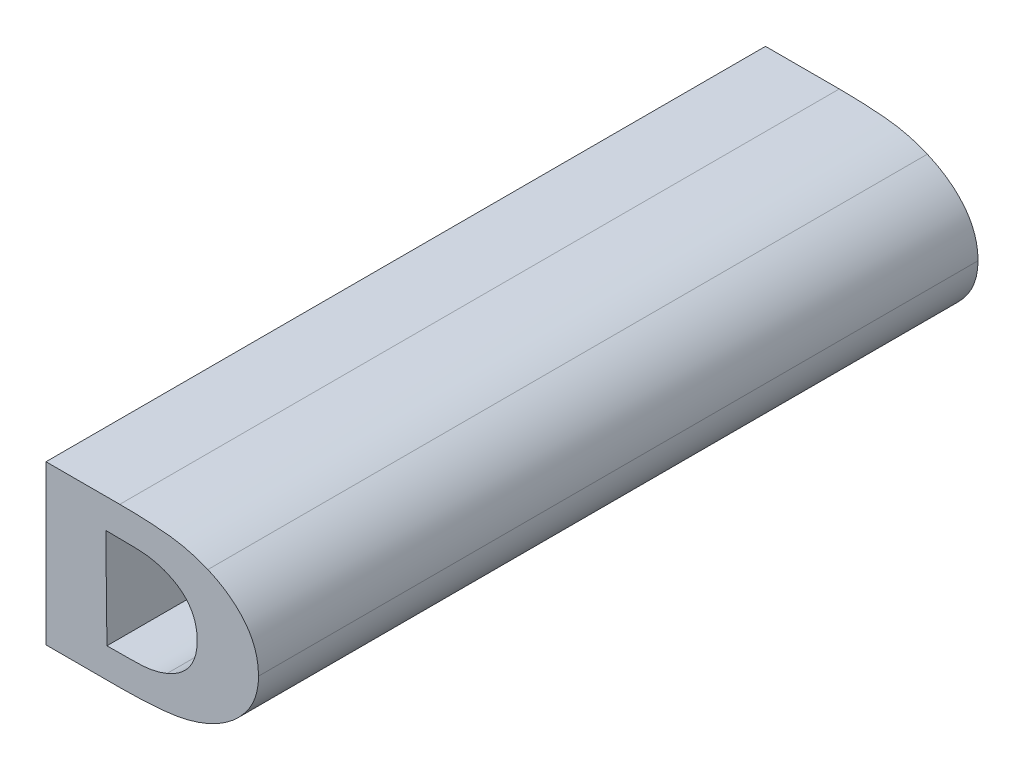
ISO-10303-21;
HEADER;
FILE_DESCRIPTION(('STEP AP214'),'2;1');
FILE_NAME('part.step','',(''),(''),'','','');
FILE_SCHEMA(('AUTOMOTIVE_DESIGN { 1 0 10303 214 1 1 1 1 }'));
ENDSEC;
DATA;
#1=APPLICATION_CONTEXT('core data for automotive mechanical design processes');
#2=APPLICATION_PROTOCOL_DEFINITION('international standard','automotive_design',2000,#1);
#3=PRODUCT_CONTEXT('',#1,'mechanical');
#4=PRODUCT('Part','Part','',(#3));
#5=PRODUCT_RELATED_PRODUCT_CATEGORY('part','',(#4));
#6=PRODUCT_DEFINITION_FORMATION('','',#4);
#7=PRODUCT_DEFINITION_CONTEXT('part definition',#1,'design');
#8=PRODUCT_DEFINITION('design','',#6,#7);
#9=PRODUCT_DEFINITION_SHAPE('','',#8);
#10=(LENGTH_UNIT() NAMED_UNIT(*) SI_UNIT(.MILLI.,.METRE.));
#11=(NAMED_UNIT(*) PLANE_ANGLE_UNIT() SI_UNIT($,.RADIAN.));
#12=(NAMED_UNIT(*) SI_UNIT($,.STERADIAN.) SOLID_ANGLE_UNIT());
#13=UNCERTAINTY_MEASURE_WITH_UNIT(LENGTH_MEASURE(1.E-05),#10,'distance_accuracy_value','');
#14=(GEOMETRIC_REPRESENTATION_CONTEXT(3) GLOBAL_UNCERTAINTY_ASSIGNED_CONTEXT((#13)) GLOBAL_UNIT_ASSIGNED_CONTEXT((#10,
#11,#12)) REPRESENTATION_CONTEXT('',''));
#15=CARTESIAN_POINT('',(0.,0.,0.));
#16=DIRECTION('',(0.,0.,1.));
#17=DIRECTION('',(1.,0.,0.));
#18=AXIS2_PLACEMENT_3D('',#15,#16,#17);
#19=CARTESIAN_POINT('',(-1.2249384485095,-0.398085013600293,0.));
#20=CARTESIAN_POINT('',(-1.2249384485095,-0.398085013600293,0.1));
#21=CARTESIAN_POINT('',(-1.2228835457298,-0.397227315048791,0.));
#22=CARTESIAN_POINT('',(-1.2228835457298,-0.397227315048791,0.1));
#23=CARTESIAN_POINT('',(-1.2207571680709,-0.394207501398713,0.));
#24=CARTESIAN_POINT('',(-1.2207571680709,-0.394207501398713,0.1));
#25=CARTESIAN_POINT('',(-1.2207571680709,-0.392027517580314,0.));
#26=CARTESIAN_POINT('',(-1.2207571680709,-0.392027517580314,0.1));
#27=B_SPLINE_SURFACE_WITH_KNOTS('',2,1,((#19,#20),(#21,#22),(#23,#24),(#25,#26)),.UNSPECIFIED.,
.F.,.F.,.F.,(3,1,3),(2,2),(0.,1.,2.),(0.,0.01),.UNSPECIFIED.);
#28=CARTESIAN_POINT('',(-1.2249384485095,-0.398085013600293,0.));
#29=CARTESIAN_POINT('',(-1.2228835457298,-0.397227315048791,0.));
#30=CARTESIAN_POINT('',(-1.2207571680709,-0.394207501398713,0.));
#31=CARTESIAN_POINT('',(-1.2207571680709,-0.392027517580314,0.));
#32=B_SPLINE_CURVE_WITH_KNOTS('',2,(#28,#29,#30,#31),.UNSPECIFIED.,.F.,.F.,(3,1,3),(0.,1.,2.),.UNSPECIFIED.);
#33=CARTESIAN_POINT('',(-1.2249384485095,-0.398085013600293,0.));
#34=VERTEX_POINT('',#33);
#35=CARTESIAN_POINT('',(-1.2207571680709,-0.392027517580314,0.));
#36=VERTEX_POINT('',#35);
#37=EDGE_CURVE('E11',#34,#36,#32,.T.);
#38=DIRECTION('',(0.,0.,1.));
#39=VECTOR('',#38,1.);
#40=CARTESIAN_POINT('',(-1.2249384485095,-0.398085013600293,0.));
#41=LINE('',#40,#39);
#42=CARTESIAN_POINT('',(-1.2249384485095,-0.398085013600293,0.1));
#43=VERTEX_POINT('',#42);
#44=EDGE_CURVE('E28',#34,#43,#41,.T.);
#45=CARTESIAN_POINT('',(-1.2207571680709,-0.392027517580314,0.1));
#46=CARTESIAN_POINT('',(-1.2207571680709,-0.394207501398713,0.1));
#47=CARTESIAN_POINT('',(-1.2228835457298,-0.397227315048791,0.1));
#48=CARTESIAN_POINT('',(-1.2249384485095,-0.398085013600293,0.1));
#49=B_SPLINE_CURVE_WITH_KNOTS('',2,(#45,#46,#47,#48),.UNSPECIFIED.,.F.,.F.,(3,1,3),(-2.,-1.,0.),.UNSPECIFIED.);
#50=CARTESIAN_POINT('',(-1.2207571680709,-0.392027517580314,0.1));
#51=VERTEX_POINT('',#50);
#52=EDGE_CURVE('E329',#51,#43,#49,.T.);
#53=DIRECTION('',(0.,0.,1.));
#54=VECTOR('',#53,1.);
#55=CARTESIAN_POINT('',(-1.2207571680709,-0.392027517580314,0.));
#56=LINE('',#55,#54);
#57=EDGE_CURVE('E41',#36,#51,#56,.T.);
#58=ORIENTED_EDGE('',*,*,#37,.F.);
#59=ORIENTED_EDGE('',*,*,#44,.T.);
#60=ORIENTED_EDGE('',*,*,#52,.F.);
#61=ORIENTED_EDGE('',*,*,#57,.F.);
#62=EDGE_LOOP('',(#58,#59,#60,#61));
#63=FACE_BOUND('',#62,.T.);
#64=ADVANCED_FACE('F17',(#63),#27,.F.);
#65=CARTESIAN_POINT('',(-1.2333010093866,-0.398942712151794,0.));
#66=CARTESIAN_POINT('',(-1.2333010093866,-0.398942712151794,0.1));
#67=CARTESIAN_POINT('',(-1.2305134890942,-0.398942712151794,0.));
#68=CARTESIAN_POINT('',(-1.2305134890942,-0.398942712151794,0.1));
#69=CARTESIAN_POINT('',(-1.2266717143323,-0.398817631113033,0.));
#70=CARTESIAN_POINT('',(-1.2266717143323,-0.398817631113033,0.1));
#71=CARTESIAN_POINT('',(-1.2249384485095,-0.398085013600293,0.));
#72=CARTESIAN_POINT('',(-1.2249384485095,-0.398085013600293,0.1));
#73=B_SPLINE_SURFACE_WITH_KNOTS('',2,1,((#65,#66),(#67,#68),(#69,#70),(#71,#72)),.UNSPECIFIED.,
.F.,.F.,.F.,(3,1,3),(2,2),(0.,1.,2.),(0.,0.01),.UNSPECIFIED.);
#74=CARTESIAN_POINT('',(-1.2333010093866,-0.398942712151794,0.));
#75=CARTESIAN_POINT('',(-1.2305134890942,-0.398942712151794,0.));
#76=CARTESIAN_POINT('',(-1.2266717143323,-0.398817631113033,0.));
#77=CARTESIAN_POINT('',(-1.2249384485095,-0.398085013600293,0.));
#78=B_SPLINE_CURVE_WITH_KNOTS('',2,(#74,#75,#76,#77),.UNSPECIFIED.,.F.,.F.,(3,1,3),(0.,1.,2.),.UNSPECIFIED.);
#79=CARTESIAN_POINT('',(-1.2333010093866,-0.398942712151794,0.));
#80=VERTEX_POINT('',#79);
#81=EDGE_CURVE('E322',#80,#34,#78,.T.);
#82=CARTESIAN_POINT('',(-1.2333010093866,-0.398942712151794,0.));
#83=CARTESIAN_POINT('',(-1.2333010093866,-0.398942712151794,0.00416666666666667));
#84=CARTESIAN_POINT('',(-1.2333010093866,-0.398942712151794,0.00833333333333334));
#85=CARTESIAN_POINT('',(-1.2333010093866,-0.398942712151794,0.0166666666666667));
#86=CARTESIAN_POINT('',(-1.2333010093866,-0.398942712151794,0.0208333333333333));
#87=CARTESIAN_POINT('',(-1.2333010093866,-0.398942712151794,0.0291666666666667));
#88=CARTESIAN_POINT('',(-1.2333010093866,-0.398942712151794,0.0333333333333333));
#89=CARTESIAN_POINT('',(-1.2333010093866,-0.398942712151794,0.0416666666666667));
#90=CARTESIAN_POINT('',(-1.2333010093866,-0.398942712151794,0.0458333333333333));
#91=CARTESIAN_POINT('',(-1.2333010093866,-0.398942712151794,0.0541666666666667));
#92=CARTESIAN_POINT('',(-1.2333010093866,-0.398942712151794,0.0583333333333333));
#93=CARTESIAN_POINT('',(-1.2333010093866,-0.398942712151794,0.0666666666666667));
#94=CARTESIAN_POINT('',(-1.2333010093866,-0.398942712151794,0.0708333333333333));
#95=CARTESIAN_POINT('',(-1.2333010093866,-0.398942712151794,0.0791666666666667));
#96=CARTESIAN_POINT('',(-1.2333010093866,-0.398942712151794,0.0833333333333333));
#97=CARTESIAN_POINT('',(-1.2333010093866,-0.398942712151794,0.0916666666666667));
#98=CARTESIAN_POINT('',(-1.2333010093866,-0.398942712151794,0.0958333333333333));
#99=CARTESIAN_POINT('',(-1.2333010093866,-0.398942712151794,0.1));
#100=B_SPLINE_CURVE_WITH_KNOTS('',3,(#82,#83,#84,#85,#86,#87,#88,#89,#90,#91,#92,#93,#94,#95,
#96,#97,#98,#99),.UNSPECIFIED.,.F.,.F.,(4,2,2,2,2,2,2,2,4),(0.,0.0125,0.025,0.0375,0.05,0.0625,
0.075,0.0875,0.1),.UNSPECIFIED.);
#101=CARTESIAN_POINT('',(-1.2333010093866,-0.398942712151794,0.1));
#102=VERTEX_POINT('',#101);
#103=EDGE_CURVE('E277',#80,#102,#100,.T.);
#104=CARTESIAN_POINT('',(-1.2249384485095,-0.398085013600293,0.1));
#105=CARTESIAN_POINT('',(-1.2266717143323,-0.398817631113033,0.1));
#106=CARTESIAN_POINT('',(-1.2305134890942,-0.398942712151794,0.1));
#107=CARTESIAN_POINT('',(-1.2333010093866,-0.398942712151794,0.1));
#108=B_SPLINE_CURVE_WITH_KNOTS('',2,(#104,#105,#106,#107),.UNSPECIFIED.,.F.,.F.,(3,1,3),(-2.,
-1.,0.),.UNSPECIFIED.);
#109=EDGE_CURVE('E268',#43,#102,#108,.T.);
#110=ORIENTED_EDGE('',*,*,#81,.F.);
#111=ORIENTED_EDGE('',*,*,#103,.T.);
#112=ORIENTED_EDGE('',*,*,#109,.F.);
#113=ORIENTED_EDGE('',*,*,#44,.F.);
#114=EDGE_LOOP('',(#110,#111,#112,#113));
#115=FACE_BOUND('',#114,.T.);
#116=ADVANCED_FACE('F293',(#115),#73,.F.);
#117=CARTESIAN_POINT('',(-1.233461827865,-0.385130191728657,0.));
#118=DIRECTION('',(-1.,0.,0.));
#119=DIRECTION('',(0.,-1.,0.));
#120=AXIS2_PLACEMENT_3D('',#117,#118,#119);
#121=PLANE('',#120);
#122=DIRECTION('',(0.,-1.,0.));
#123=VECTOR('',#122,1.);
#124=CARTESIAN_POINT('',(-1.233461827865,-0.38858289968363,0.));
#125=LINE('',#124,#123);
#126=CARTESIAN_POINT('',(-1.233461827865,-0.385130191728657,0.));
#127=VERTEX_POINT('',#126);
#128=EDGE_CURVE('E263',#127,#80,#125,.T.);
#129=ORIENTED_EDGE('',*,*,#128,.F.);
#130=DIRECTION('',(0.,0.,1.));
#131=VECTOR('',#130,1.);
#132=CARTESIAN_POINT('',(-1.233461827865,-0.385130191728657,0.));
#133=LINE('',#132,#131);
#134=CARTESIAN_POINT('',(-1.233461827865,-0.385130191728657,0.1));
#135=VERTEX_POINT('',#134);
#136=EDGE_CURVE('E259',#127,#135,#133,.T.);
#137=ORIENTED_EDGE('',*,*,#136,.T.);
#138=DIRECTION('',(0.,1.,0.));
#139=VECTOR('',#138,1.);
#140=CARTESIAN_POINT('',(-1.233461827865,-0.38858289968363,0.1));
#141=LINE('',#140,#139);
#142=EDGE_CURVE('E254',#102,#135,#141,.T.);
#143=ORIENTED_EDGE('',*,*,#142,.F.);
#144=ORIENTED_EDGE('',*,*,#103,.F.);
#145=EDGE_LOOP('',(#129,#137,#143,#144));
#146=FACE_BOUND('',#145,.T.);
#147=ADVANCED_FACE('F283',(#146),#121,.F.);
#148=CARTESIAN_POINT('',(-1.2253315603456,-0.385862809241398,0.));
#149=CARTESIAN_POINT('',(-1.2253315603456,-0.385862809241398,0.1));
#150=CARTESIAN_POINT('',(-1.2270290887288,-0.385255272767417,0.));
#151=CARTESIAN_POINT('',(-1.2270290887288,-0.385255272767417,0.1));
#152=CARTESIAN_POINT('',(-1.2307279137321,-0.385130191728657,0.));
#153=CARTESIAN_POINT('',(-1.2307279137321,-0.385130191728657,0.1));
#154=CARTESIAN_POINT('',(-1.2333010093866,-0.385130191728657,0.));
#155=CARTESIAN_POINT('',(-1.2333010093866,-0.385130191728657,0.1));
#156=B_SPLINE_SURFACE_WITH_KNOTS('',2,1,((#148,#149),(#150,#151),(#152,#153),(#154,#155)),
.UNSPECIFIED.,.F.,.F.,.F.,(3,1,3),(2,2),(0.,1.,2.),(0.,0.01),.UNSPECIFIED.);
#157=CARTESIAN_POINT('',(-1.2253315603456,-0.385862809241398,0.));
#158=CARTESIAN_POINT('',(-1.2270290887288,-0.385255272767417,0.));
#159=CARTESIAN_POINT('',(-1.2307279137321,-0.385130191728657,0.));
#160=CARTESIAN_POINT('',(-1.2333010093866,-0.385130191728657,0.));
#161=B_SPLINE_CURVE_WITH_KNOTS('',2,(#157,#158,#159,#160),.UNSPECIFIED.,.F.,.F.,(3,1,3),(0.,1.,
2.),.UNSPECIFIED.);
#162=CARTESIAN_POINT('',(-1.2253315603456,-0.385862809241398,0.));
#163=VERTEX_POINT('',#162);
#164=EDGE_CURVE('E244',#163,#127,#161,.T.);
#165=DIRECTION('',(0.,0.,1.));
#166=VECTOR('',#165,1.);
#167=CARTESIAN_POINT('',(-1.2253315603456,-0.385862809241398,0.));
#168=LINE('',#167,#166);
#169=CARTESIAN_POINT('',(-1.2253315603456,-0.385862809241398,0.1));
#170=VERTEX_POINT('',#169);
#171=EDGE_CURVE('E241',#163,#170,#168,.T.);
#172=CARTESIAN_POINT('',(-1.2333010093866,-0.385130191728657,0.1));
#173=CARTESIAN_POINT('',(-1.2307279137321,-0.385130191728657,0.1));
#174=CARTESIAN_POINT('',(-1.2270290887288,-0.385255272767417,0.1));
#175=CARTESIAN_POINT('',(-1.2253315603456,-0.385862809241398,0.1));
#176=B_SPLINE_CURVE_WITH_KNOTS('',2,(#172,#173,#174,#175),.UNSPECIFIED.,.F.,.F.,(3,1,3),(-2.,
-1.,0.),.UNSPECIFIED.);
#177=EDGE_CURVE('E229',#135,#170,#176,.T.);
#178=CARTESIAN_POINT('',(-1.2253315603456,-0.385862809241398,0.));
#179=CARTESIAN_POINT('',(-1.2253315603456,-0.385862809241398,0.1));
#180=CARTESIAN_POINT('',(-1.2270290887288,-0.385255272767417,0.));
#181=CARTESIAN_POINT('',(-1.2270290887288,-0.385255272767417,0.1));
#182=CARTESIAN_POINT('',(-1.2307279137321,-0.385130191728657,0.));
#183=CARTESIAN_POINT('',(-1.2307279137321,-0.385130191728657,0.1));
#184=CARTESIAN_POINT('',(-1.2333010093866,-0.385130191728657,0.));
#185=CARTESIAN_POINT('',(-1.2333010093866,-0.385130191728657,0.1));
#186=CARTESIAN_POINT('',(-1.23340136011713,-0.385130191728657,0.));
#187=CARTESIAN_POINT('',(-1.23340136011713,-0.385130191728657,0.1));
#188=CARTESIAN_POINT('',(-1.23350171084765,-0.385130191728657,0.));
#189=CARTESIAN_POINT('',(-1.23350171084765,-0.385130191728657,0.1));
#190=B_SPLINE_SURFACE_WITH_KNOTS('',2,1,((#178,#179),(#180,#181),(#182,#183),(#184,#185),(#186,
#187),(#188,#189)),.UNSPECIFIED.,.F.,.F.,.F.,(3,1,2,3),(2,2),(0.,1.,2.,2.039),(0.,0.01),.UNSPECIFIED.);
#191=ORIENTED_EDGE('',*,*,#164,.F.);
#192=ORIENTED_EDGE('',*,*,#171,.T.);
#193=ORIENTED_EDGE('',*,*,#177,.F.);
#194=ORIENTED_EDGE('',*,*,#136,.F.);
#195=EDGE_LOOP('',(#191,#192,#193,#194));
#196=FACE_BOUND('',#195,.T.);
#197=ADVANCED_FACE('F292',(#196),#190,.F.);
#198=CARTESIAN_POINT('',(-1.2207571680709,-0.392027517580314,0.));
#199=CARTESIAN_POINT('',(-1.2207571680709,-0.392027517580314,0.1));
#200=CARTESIAN_POINT('',(-1.2207571680709,-0.389847533761915,0.));
#201=CARTESIAN_POINT('',(-1.2207571680709,-0.389847533761915,0.1));
#202=CARTESIAN_POINT('',(-1.2230086267686,-0.386738376512722,0.));
#203=CARTESIAN_POINT('',(-1.2230086267686,-0.386738376512722,0.1));
#204=CARTESIAN_POINT('',(-1.2253315603456,-0.385862809241398,0.));
#205=CARTESIAN_POINT('',(-1.2253315603456,-0.385862809241398,0.1));
#206=B_SPLINE_SURFACE_WITH_KNOTS('',2,1,((#198,#199),(#200,#201),(#202,#203),(#204,#205)),
.UNSPECIFIED.,.F.,.F.,.F.,(3,1,3),(2,2),(0.,1.,2.),(0.,0.01),.UNSPECIFIED.);
#207=CARTESIAN_POINT('',(-1.2207571680709,-0.392027517580314,0.));
#208=CARTESIAN_POINT('',(-1.2207571680709,-0.389847533761915,0.));
#209=CARTESIAN_POINT('',(-1.2230086267686,-0.386738376512722,0.));
#210=CARTESIAN_POINT('',(-1.2253315603456,-0.385862809241398,0.));
#211=B_SPLINE_CURVE_WITH_KNOTS('',2,(#207,#208,#209,#210),.UNSPECIFIED.,.F.,.F.,(3,1,3),(0.,1.,
2.),.UNSPECIFIED.);
#212=EDGE_CURVE('E221',#36,#163,#211,.T.);
#213=CARTESIAN_POINT('',(-1.2253315603456,-0.385862809241398,0.1));
#214=CARTESIAN_POINT('',(-1.2230086267686,-0.386738376512722,0.1));
#215=CARTESIAN_POINT('',(-1.2207571680709,-0.389847533761915,0.1));
#216=CARTESIAN_POINT('',(-1.2207571680709,-0.392027517580314,0.1));
#217=B_SPLINE_CURVE_WITH_KNOTS('',2,(#213,#214,#215,#216),.UNSPECIFIED.,.F.,.F.,(3,1,3),(-2.,
-1.,0.),.UNSPECIFIED.);
#218=EDGE_CURVE('E213',#170,#51,#217,.T.);
#219=ORIENTED_EDGE('',*,*,#212,.F.);
#220=ORIENTED_EDGE('',*,*,#57,.T.);
#221=ORIENTED_EDGE('',*,*,#218,.F.);
#222=ORIENTED_EDGE('',*,*,#171,.F.);
#223=EDGE_LOOP('',(#219,#220,#221,#222));
#224=FACE_BOUND('',#223,.T.);
#225=ADVANCED_FACE('F339',(#224),#206,.F.);
#226=CARTESIAN_POINT('',(-1.2314247938052,-0.403070386430895,0.));
#227=CARTESIAN_POINT('',(-1.2314247938052,-0.403070386430895,0.1));
#228=CARTESIAN_POINT('',(-1.2279939995992,-0.403070386430895,0.));
#229=CARTESIAN_POINT('',(-1.2279939995992,-0.403070386430895,0.1));
#230=CARTESIAN_POINT('',(-1.2219365035792,-0.402427112517269,0.));
#231=CARTESIAN_POINT('',(-1.2219365035792,-0.402427112517269,0.1));
#232=CARTESIAN_POINT('',(-1.2193634079247,-0.401319251888246,0.));
#233=CARTESIAN_POINT('',(-1.2193634079247,-0.401319251888246,0.1));
#234=B_SPLINE_SURFACE_WITH_KNOTS('',2,1,((#226,#227),(#228,#229),(#230,#231),(#232,#233)),
.UNSPECIFIED.,.F.,.F.,.F.,(3,1,3),(2,2),(-2.,-1.,0.),(0.,0.01),.UNSPECIFIED.);
#235=CARTESIAN_POINT('',(-1.2193634079247,-0.401319251888246,0.));
#236=CARTESIAN_POINT('',(-1.2219365035792,-0.402427112517269,0.));
#237=CARTESIAN_POINT('',(-1.2279939995992,-0.403070386430895,0.));
#238=CARTESIAN_POINT('',(-1.2314247938052,-0.403070386430895,0.));
#239=B_SPLINE_CURVE_WITH_KNOTS('',2,(#235,#236,#237,#238),.UNSPECIFIED.,.F.,.F.,(3,1,3),(0.,1.,
2.),.UNSPECIFIED.);
#240=CARTESIAN_POINT('',(-1.2193634079247,-0.401319251888246,0.));
#241=VERTEX_POINT('',#240);
#242=CARTESIAN_POINT('',(-1.2314247938052,-0.403070386430895,0.));
#243=VERTEX_POINT('',#242);
#244=EDGE_CURVE('E209',#241,#243,#239,.T.);
#245=DIRECTION('',(0.,0.,1.));
#246=VECTOR('',#245,1.);
#247=CARTESIAN_POINT('',(-1.2193634079247,-0.401319251888246,0.));
#248=LINE('',#247,#246);
#249=CARTESIAN_POINT('',(-1.2193634079247,-0.401319251888246,0.1));
#250=VERTEX_POINT('',#249);
#251=EDGE_CURVE('E204',#241,#250,#248,.T.);
#252=CARTESIAN_POINT('',(-1.2314247938052,-0.403070386430895,0.1));
#253=CARTESIAN_POINT('',(-1.2279939995992,-0.403070386430895,0.1));
#254=CARTESIAN_POINT('',(-1.2219365035792,-0.402427112517269,0.1));
#255=CARTESIAN_POINT('',(-1.2193634079247,-0.401319251888246,0.1));
#256=B_SPLINE_CURVE_WITH_KNOTS('',2,(#252,#253,#254,#255),.UNSPECIFIED.,.F.,.F.,(3,1,3),(-2.,
-1.,0.),.UNSPECIFIED.);
#257=CARTESIAN_POINT('',(-1.2314247938052,-0.403070386430895,0.1));
#258=VERTEX_POINT('',#257);
#259=EDGE_CURVE('E135',#258,#250,#256,.T.);
#260=DIRECTION('',(0.,0.,1.));
#261=VECTOR('',#260,1.);
#262=CARTESIAN_POINT('',(-1.2314247938052,-0.403070386430895,0.));
#263=LINE('',#262,#261);
#264=EDGE_CURVE('E198',#243,#258,#263,.T.);
#265=ORIENTED_EDGE('',*,*,#244,.F.);
#266=ORIENTED_EDGE('',*,*,#251,.T.);
#267=ORIENTED_EDGE('',*,*,#259,.F.);
#268=ORIENTED_EDGE('',*,*,#264,.F.);
#269=EDGE_LOOP('',(#265,#266,#267,#268));
#270=FACE_BOUND('',#269,.T.);
#271=ADVANCED_FACE('F350',(#270),#234,.T.);
#272=CARTESIAN_POINT('',(-1.2417707825827,-0.403070386430895,0.));
#273=DIRECTION('',(0.,-1.,0.));
#274=DIRECTION('',(1.,0.,0.));
#275=AXIS2_PLACEMENT_3D('',#272,#273,#274);
#276=PLANE('',#275);
#277=DIRECTION('',(-1.,0.,0.));
#278=VECTOR('',#277,1.);
#279=CARTESIAN_POINT('',(-1.2314247938052,-0.403070386430895,0.));
#280=LINE('',#279,#278);
#281=CARTESIAN_POINT('',(-1.2417707825827,-0.403070386430895,0.));
#282=VERTEX_POINT('',#281);
#283=EDGE_CURVE('E196',#243,#282,#280,.T.);
#284=ORIENTED_EDGE('',*,*,#283,.F.);
#285=ORIENTED_EDGE('',*,*,#264,.T.);
#286=DIRECTION('',(1.,0.,0.));
#287=VECTOR('',#286,1.);
#288=CARTESIAN_POINT('',(-1.2314247938052,-0.403070386430895,0.1));
#289=LINE('',#288,#287);
#290=CARTESIAN_POINT('',(-1.2417707825827,-0.403070386430895,0.1));
#291=VERTEX_POINT('',#290);
#292=EDGE_CURVE('E194',#291,#258,#289,.T.);
#293=ORIENTED_EDGE('',*,*,#292,.F.);
#294=DIRECTION('',(0.,0.,1.));
#295=VECTOR('',#294,1.);
#296=CARTESIAN_POINT('',(-1.2417707825827,-0.403070386430895,0.));
#297=LINE('',#296,#295);
#298=EDGE_CURVE('E191',#282,#291,#297,.T.);
#299=ORIENTED_EDGE('',*,*,#298,.F.);
#300=EDGE_LOOP('',(#284,#285,#293,#299));
#301=FACE_BOUND('',#300,.T.);
#302=ADVANCED_FACE('F390',(#301),#276,.T.);
#303=CARTESIAN_POINT('',(-1.2417707825827,-0.381020386169379,0.));
#304=DIRECTION('',(-1.,0.,0.));
#305=DIRECTION('',(0.,-1.,0.));
#306=AXIS2_PLACEMENT_3D('',#303,#304,#305);
#307=PLANE('',#306);
#308=DIRECTION('',(0.,1.,0.));
#309=VECTOR('',#308,1.);
#310=CARTESIAN_POINT('',(-1.2417707825827,-0.403070386430895,0.));
#311=LINE('',#310,#309);
#312=CARTESIAN_POINT('',(-1.2417707825827,-0.381020386169379,0.));
#313=VERTEX_POINT('',#312);
#314=EDGE_CURVE('E189',#282,#313,#311,.T.);
#315=ORIENTED_EDGE('',*,*,#314,.F.);
#316=ORIENTED_EDGE('',*,*,#298,.T.);
#317=DIRECTION('',(0.,-1.,0.));
#318=VECTOR('',#317,1.);
#319=CARTESIAN_POINT('',(-1.2417707825827,-0.403070386430895,0.1));
#320=LINE('',#319,#318);
#321=CARTESIAN_POINT('',(-1.2417707825827,-0.381020386169379,0.1));
#322=VERTEX_POINT('',#321);
#323=EDGE_CURVE('E186',#322,#291,#320,.T.);
#324=ORIENTED_EDGE('',*,*,#323,.F.);
#325=DIRECTION('',(0.,0.,1.));
#326=VECTOR('',#325,1.);
#327=CARTESIAN_POINT('',(-1.2417707825827,-0.381020386169379,0.));
#328=LINE('',#327,#326);
#329=EDGE_CURVE('E183',#313,#322,#328,.T.);
#330=ORIENTED_EDGE('',*,*,#329,.F.);
#331=EDGE_LOOP('',(#315,#316,#324,#330));
#332=FACE_BOUND('',#331,.T.);
#333=ADVANCED_FACE('F400',(#332),#307,.T.);
#334=CARTESIAN_POINT('',(-1.2315141374043,-0.381020386169379,0.));
#335=DIRECTION('',(0.,1.,0.));
#336=DIRECTION('',(-1.,0.,0.));
#337=AXIS2_PLACEMENT_3D('',#334,#335,#336);
#338=PLANE('',#337);
#339=DIRECTION('',(1.,0.,0.));
#340=VECTOR('',#339,1.);
#341=CARTESIAN_POINT('',(-1.2417707825827,-0.381020386169379,0.));
#342=LINE('',#341,#340);
#343=CARTESIAN_POINT('',(-1.2315141374043,-0.381020386169379,0.));
#344=VERTEX_POINT('',#343);
#345=EDGE_CURVE('E181',#313,#344,#342,.T.);
#346=ORIENTED_EDGE('',*,*,#345,.F.);
#347=ORIENTED_EDGE('',*,*,#329,.T.);
#348=DIRECTION('',(-1.,0.,0.));
#349=VECTOR('',#348,1.);
#350=CARTESIAN_POINT('',(-1.2417707825827,-0.381020386169379,0.1));
#351=LINE('',#350,#349);
#352=CARTESIAN_POINT('',(-1.2315141374043,-0.381020386169379,0.1));
#353=VERTEX_POINT('',#352);
#354=EDGE_CURVE('E178',#353,#322,#351,.T.);
#355=ORIENTED_EDGE('',*,*,#354,.F.);
#356=DIRECTION('',(0.,0.,1.));
#357=VECTOR('',#356,1.);
#358=CARTESIAN_POINT('',(-1.2315141374043,-0.381020386169379,0.));
#359=LINE('',#358,#357);
#360=EDGE_CURVE('E172',#344,#353,#359,.T.);
#361=ORIENTED_EDGE('',*,*,#360,.F.);
#362=EDGE_LOOP('',(#346,#347,#355,#361));
#363=FACE_BOUND('',#362,.T.);
#364=ADVANCED_FACE('F410',(#363),#338,.T.);
#365=CARTESIAN_POINT('',(-1.2192740643256,-0.382753651992205,0.));
#366=CARTESIAN_POINT('',(-1.2192740643256,-0.382753651992205,0.1));
#367=CARTESIAN_POINT('',(-1.2219365035792,-0.381610053923536,0.));
#368=CARTESIAN_POINT('',(-1.2219365035792,-0.381610053923536,0.1));
#369=CARTESIAN_POINT('',(-1.2280297370388,-0.381020386169379,0.));
#370=CARTESIAN_POINT('',(-1.2280297370388,-0.381020386169379,0.1));
#371=CARTESIAN_POINT('',(-1.2315141374043,-0.381020386169379,0.));
#372=CARTESIAN_POINT('',(-1.2315141374043,-0.381020386169379,0.1));
#373=B_SPLINE_SURFACE_WITH_KNOTS('',2,1,((#365,#366),(#367,#368),(#369,#370),(#371,#372)),
.UNSPECIFIED.,.F.,.F.,.F.,(3,1,3),(2,2),(-2.,-1.,0.),(0.,0.01),.UNSPECIFIED.);
#374=CARTESIAN_POINT('',(-1.2315141374043,-0.381020386169379,0.));
#375=CARTESIAN_POINT('',(-1.2280297370388,-0.381020386169379,0.));
#376=CARTESIAN_POINT('',(-1.2219365035792,-0.381610053923536,0.));
#377=CARTESIAN_POINT('',(-1.2192740643256,-0.382753651992205,0.));
#378=B_SPLINE_CURVE_WITH_KNOTS('',2,(#374,#375,#376,#377),.UNSPECIFIED.,.F.,.F.,(3,1,3),(0.,1.,
2.),.UNSPECIFIED.);
#379=CARTESIAN_POINT('',(-1.2192740643256,-0.382753651992205,0.));
#380=VERTEX_POINT('',#379);
#381=EDGE_CURVE('E165',#344,#380,#378,.T.);
#382=CARTESIAN_POINT('',(-1.2192740643256,-0.382753651992205,0.1));
#383=CARTESIAN_POINT('',(-1.2219365035792,-0.381610053923536,0.1));
#384=CARTESIAN_POINT('',(-1.2280297370388,-0.381020386169379,0.1));
#385=CARTESIAN_POINT('',(-1.2315141374043,-0.381020386169379,0.1));
#386=B_SPLINE_CURVE_WITH_KNOTS('',2,(#382,#383,#384,#385),.UNSPECIFIED.,.F.,.F.,(3,1,3),(-2.,
-1.,0.),.UNSPECIFIED.);
#387=CARTESIAN_POINT('',(-1.2192740643256,-0.382753651992205,0.1));
#388=VERTEX_POINT('',#387);
#389=EDGE_CURVE('E161',#388,#353,#386,.T.);
#390=DIRECTION('',(0.,0.,1.));
#391=VECTOR('',#390,1.);
#392=CARTESIAN_POINT('',(-1.2192740643256,-0.382753651992205,0.));
#393=LINE('',#392,#391);
#394=EDGE_CURVE('E117',#380,#388,#393,.T.);
#395=ORIENTED_EDGE('',*,*,#381,.F.);
#396=ORIENTED_EDGE('',*,*,#360,.T.);
#397=ORIENTED_EDGE('',*,*,#389,.F.);
#398=ORIENTED_EDGE('',*,*,#394,.F.);
#399=EDGE_LOOP('',(#395,#396,#397,#398));
#400=FACE_BOUND('',#399,.T.);
#401=ADVANCED_FACE('F420',(#400),#373,.T.);
#402=CARTESIAN_POINT('',(-1.2122337887154,-0.39206325501996,0.));
#403=CARTESIAN_POINT('',(-1.2122337887154,-0.39206325501996,0.1));
#404=CARTESIAN_POINT('',(-1.2122337887154,-0.388864754171653,0.));
#405=CARTESIAN_POINT('',(-1.2122337887154,-0.388864754171653,0.1));
#406=CARTESIAN_POINT('',(-1.216004088598,-0.384147412138395,0.));
#407=CARTESIAN_POINT('',(-1.216004088598,-0.384147412138395,0.1));
#408=CARTESIAN_POINT('',(-1.2192740643256,-0.382753651992205,0.));
#409=CARTESIAN_POINT('',(-1.2192740643256,-0.382753651992205,0.1));
#410=B_SPLINE_SURFACE_WITH_KNOTS('',2,1,((#402,#403),(#404,#405),(#406,#407),(#408,#409)),
.UNSPECIFIED.,.F.,.F.,.F.,(3,1,3),(2,2),(-2.,-1.,0.),(0.,0.01),.UNSPECIFIED.);
#411=CARTESIAN_POINT('',(-1.2192740643256,-0.382753651992205,0.));
#412=CARTESIAN_POINT('',(-1.216004088598,-0.384147412138395,0.));
#413=CARTESIAN_POINT('',(-1.2122337887154,-0.388864754171653,0.));
#414=CARTESIAN_POINT('',(-1.2122337887154,-0.39206325501996,0.));
#415=B_SPLINE_CURVE_WITH_KNOTS('',2,(#411,#412,#413,#414),.UNSPECIFIED.,.F.,.F.,(3,1,3),(0.,1.,
2.),.UNSPECIFIED.);
#416=CARTESIAN_POINT('',(-1.2122337887154,-0.39206325501996,0.));
#417=VERTEX_POINT('',#416);
#418=EDGE_CURVE('E121',#380,#417,#415,.T.);
#419=CARTESIAN_POINT('',(-1.2122337887154,-0.39206325501996,0.1));
#420=CARTESIAN_POINT('',(-1.2122337887154,-0.388864754171653,0.1));
#421=CARTESIAN_POINT('',(-1.216004088598,-0.384147412138395,0.1));
#422=CARTESIAN_POINT('',(-1.2192740643256,-0.382753651992205,0.1));
#423=B_SPLINE_CURVE_WITH_KNOTS('',2,(#419,#420,#421,#422),.UNSPECIFIED.,.F.,.F.,(3,1,3),(-2.,
-1.,0.),.UNSPECIFIED.);
#424=CARTESIAN_POINT('',(-1.2122337887154,-0.39206325501996,0.1));
#425=VERTEX_POINT('',#424);
#426=EDGE_CURVE('E110',#425,#388,#423,.T.);
#427=DIRECTION('',(0.,0.,1.));
#428=VECTOR('',#427,1.);
#429=CARTESIAN_POINT('',(-1.2122337887154,-0.39206325501996,0.));
#430=LINE('',#429,#428);
#431=EDGE_CURVE('E114',#417,#425,#430,.T.);
#432=ORIENTED_EDGE('',*,*,#418,.F.);
#433=ORIENTED_EDGE('',*,*,#394,.T.);
#434=ORIENTED_EDGE('',*,*,#426,.F.);
#435=ORIENTED_EDGE('',*,*,#431,.F.);
#436=EDGE_LOOP('',(#432,#433,#434,#435));
#437=FACE_BOUND('',#436,.T.);
#438=ADVANCED_FACE('F113',(#437),#410,.T.);
#439=CARTESIAN_POINT('',(-1.2193634079247,-0.401319251888246,0.));
#440=CARTESIAN_POINT('',(-1.2193634079247,-0.401319251888246,0.1));
#441=CARTESIAN_POINT('',(-1.2162721193953,-0.400014835341171,0.));
#442=CARTESIAN_POINT('',(-1.2162721193953,-0.400014835341171,0.1));
#443=CARTESIAN_POINT('',(-1.2122337887154,-0.39515454354933,0.));
#444=CARTESIAN_POINT('',(-1.2122337887154,-0.39515454354933,0.1));
#445=CARTESIAN_POINT('',(-1.2122337887154,-0.39206325501996,0.));
#446=CARTESIAN_POINT('',(-1.2122337887154,-0.39206325501996,0.1));
#447=B_SPLINE_SURFACE_WITH_KNOTS('',2,1,((#439,#440),(#441,#442),(#443,#444),(#445,#446)),
.UNSPECIFIED.,.F.,.F.,.F.,(3,1,3),(2,2),(-2.,-1.,0.),(0.,0.01),.UNSPECIFIED.);
#448=CARTESIAN_POINT('',(-1.2122337887154,-0.39206325501996,0.));
#449=CARTESIAN_POINT('',(-1.2122337887154,-0.39515454354933,0.));
#450=CARTESIAN_POINT('',(-1.2162721193953,-0.400014835341171,0.));
#451=CARTESIAN_POINT('',(-1.2193634079247,-0.401319251888246,0.));
#452=B_SPLINE_CURVE_WITH_KNOTS('',2,(#448,#449,#450,#451),.UNSPECIFIED.,.F.,.F.,(3,1,3),(0.,1.,
2.),.UNSPECIFIED.);
#453=EDGE_CURVE('E129',#417,#241,#452,.T.);
#454=CARTESIAN_POINT('',(-1.2193634079247,-0.401319251888246,0.1));
#455=CARTESIAN_POINT('',(-1.2162721193953,-0.400014835341171,0.1));
#456=CARTESIAN_POINT('',(-1.2122337887154,-0.39515454354933,0.1));
#457=CARTESIAN_POINT('',(-1.2122337887154,-0.39206325501996,0.1));
#458=B_SPLINE_CURVE_WITH_KNOTS('',2,(#454,#455,#456,#457),.UNSPECIFIED.,.F.,.F.,(3,1,3),(-2.,
-1.,0.),.UNSPECIFIED.);
#459=EDGE_CURVE('E127',#250,#425,#458,.T.);
#460=ORIENTED_EDGE('',*,*,#453,.F.);
#461=ORIENTED_EDGE('',*,*,#431,.T.);
#462=ORIENTED_EDGE('',*,*,#459,.F.);
#463=ORIENTED_EDGE('',*,*,#251,.F.);
#464=EDGE_LOOP('',(#460,#461,#462,#463));
#465=FACE_BOUND('',#464,.T.);
#466=ADVANCED_FACE('F125',(#465),#447,.T.);
#467=CARTESIAN_POINT('',(-1.2303295935323,-0.392035607638604,0.));
#468=DIRECTION('',(0.,0.,1.));
#469=DIRECTION('',(1.,0.,0.));
#470=AXIS2_PLACEMENT_3D('',#467,#468,#469);
#471=PLANE('',#470);
#472=ORIENTED_EDGE('',*,*,#453,.T.);
#473=ORIENTED_EDGE('',*,*,#244,.T.);
#474=ORIENTED_EDGE('',*,*,#283,.T.);
#475=ORIENTED_EDGE('',*,*,#314,.T.);
#476=ORIENTED_EDGE('',*,*,#345,.T.);
#477=ORIENTED_EDGE('',*,*,#381,.T.);
#478=ORIENTED_EDGE('',*,*,#418,.T.);
#479=EDGE_LOOP('',(#472,#473,#474,#475,#476,#477,#478));
#480=FACE_BOUND('',#479,.T.);
#481=ORIENTED_EDGE('',*,*,#128,.T.);
#482=ORIENTED_EDGE('',*,*,#81,.T.);
#483=ORIENTED_EDGE('',*,*,#37,.T.);
#484=ORIENTED_EDGE('',*,*,#212,.T.);
#485=ORIENTED_EDGE('',*,*,#164,.T.);
#486=EDGE_LOOP('',(#481,#482,#483,#484,#485));
#487=FACE_BOUND('',#486,.T.);
#488=ADVANCED_FACE('F342',(#480,#487),#471,.F.);
#489=CARTESIAN_POINT('',(-1.2303295935323,-0.392035607638604,0.1));
#490=DIRECTION('',(0.,0.,1.));
#491=DIRECTION('',(1.,0.,0.));
#492=AXIS2_PLACEMENT_3D('',#489,#490,#491);
#493=PLANE('',#492);
#494=ORIENTED_EDGE('',*,*,#459,.T.);
#495=ORIENTED_EDGE('',*,*,#426,.T.);
#496=ORIENTED_EDGE('',*,*,#389,.T.);
#497=ORIENTED_EDGE('',*,*,#354,.T.);
#498=ORIENTED_EDGE('',*,*,#323,.T.);
#499=ORIENTED_EDGE('',*,*,#292,.T.);
#500=ORIENTED_EDGE('',*,*,#259,.T.);
#501=EDGE_LOOP('',(#494,#495,#496,#497,#498,#499,#500));
#502=FACE_BOUND('',#501,.T.);
#503=ORIENTED_EDGE('',*,*,#177,.T.);
#504=ORIENTED_EDGE('',*,*,#218,.T.);
#505=ORIENTED_EDGE('',*,*,#52,.T.);
#506=ORIENTED_EDGE('',*,*,#109,.T.);
#507=ORIENTED_EDGE('',*,*,#142,.T.);
#508=EDGE_LOOP('',(#503,#504,#505,#506,#507));
#509=FACE_BOUND('',#508,.T.);
#510=ADVANCED_FACE('F132',(#502,#509),#493,.T.);
#511=CLOSED_SHELL('',(#64,#116,#147,#197,#225,#271,#302,#333,#364,#401,#438,#466,#488,#510));
#512=MANIFOLD_SOLID_BREP('B1',#511);
#513=ADVANCED_BREP_SHAPE_REPRESENTATION('',(#18,#512),#14);
#514=SHAPE_DEFINITION_REPRESENTATION(#9,#513);
ENDSEC;
END-ISO-10303-21;
